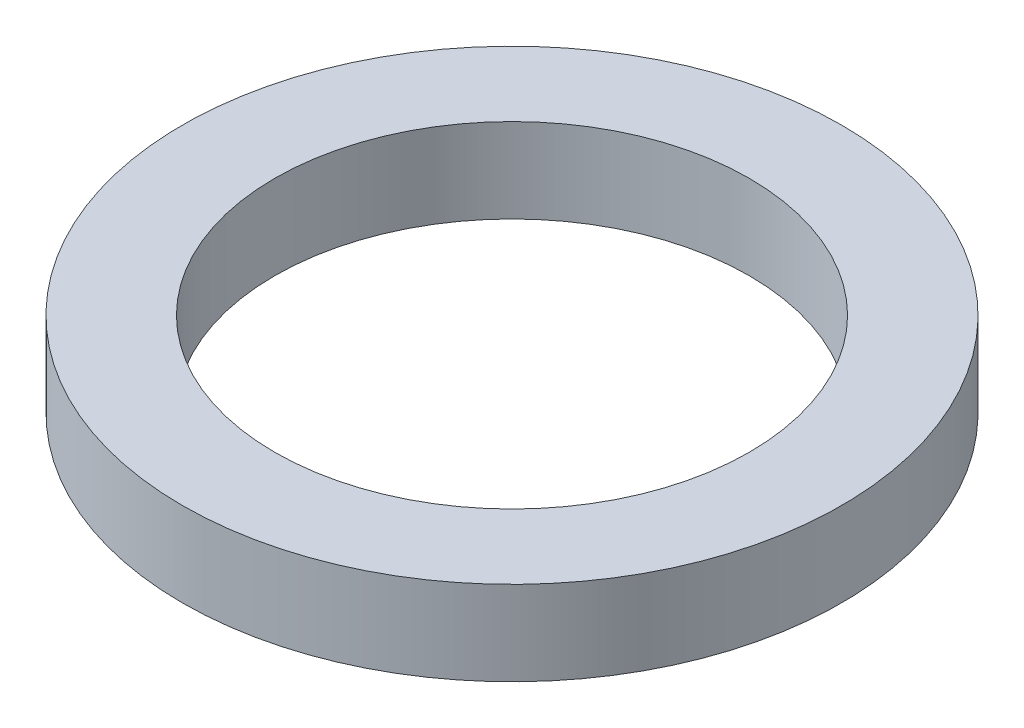
ISO-10303-21;
HEADER;
FILE_DESCRIPTION(('STEP AP214'),'2;1');
FILE_NAME('part.step','',(''),(''),'','','');
FILE_SCHEMA(('AUTOMOTIVE_DESIGN { 1 0 10303 214 1 1 1 1 }'));
ENDSEC;
DATA;
#1=APPLICATION_CONTEXT('core data for automotive mechanical design processes');
#2=APPLICATION_PROTOCOL_DEFINITION('international standard','automotive_design',2000,#1);
#3=PRODUCT_CONTEXT('',#1,'mechanical');
#4=PRODUCT('Part','Part','',(#3));
#5=PRODUCT_RELATED_PRODUCT_CATEGORY('part','',(#4));
#6=PRODUCT_DEFINITION_FORMATION('','',#4);
#7=PRODUCT_DEFINITION_CONTEXT('part definition',#1,'design');
#8=PRODUCT_DEFINITION('design','',#6,#7);
#9=PRODUCT_DEFINITION_SHAPE('','',#8);
#10=(LENGTH_UNIT() NAMED_UNIT(*) SI_UNIT(.MILLI.,.METRE.));
#11=(NAMED_UNIT(*) PLANE_ANGLE_UNIT() SI_UNIT($,.RADIAN.));
#12=(NAMED_UNIT(*) SI_UNIT($,.STERADIAN.) SOLID_ANGLE_UNIT());
#13=UNCERTAINTY_MEASURE_WITH_UNIT(LENGTH_MEASURE(1.E-05),#10,'distance_accuracy_value','');
#14=(GEOMETRIC_REPRESENTATION_CONTEXT(3) GLOBAL_UNCERTAINTY_ASSIGNED_CONTEXT((#13)) GLOBAL_UNIT_ASSIGNED_CONTEXT((#10,
#11,#12)) REPRESENTATION_CONTEXT('',''));
#15=CARTESIAN_POINT('',(0.,0.,0.));
#16=DIRECTION('',(0.,0.,1.));
#17=DIRECTION('',(1.,0.,0.));
#18=AXIS2_PLACEMENT_3D('',#15,#16,#17);
#19=CARTESIAN_POINT('',(0.,16.,0.));
#20=DIRECTION('',(0.,-1.,0.));
#21=DIRECTION('',(0.,0.,-1.));
#22=AXIS2_PLACEMENT_3D('',#19,#20,#21);
#23=CYLINDRICAL_SURFACE('',#22,62.5);
#24=CARTESIAN_POINT('',(0.,16.,0.));
#25=DIRECTION('',(0.,1.,0.));
#26=DIRECTION('',(0.,0.,1.));
#27=AXIS2_PLACEMENT_3D('',#24,#25,#26);
#28=CIRCLE('',#27,62.5);
#29=CARTESIAN_POINT('',(0.,16.,62.5));
#30=VERTEX_POINT('',#29);
#31=EDGE_CURVE('E10',#30,#30,#28,.T.);
#32=ORIENTED_EDGE('',*,*,#31,.F.);
#33=EDGE_LOOP('',(#32));
#34=FACE_BOUND('',#33,.T.);
#35=CARTESIAN_POINT('',(0.,0.,0.));
#36=DIRECTION('',(0.,1.,0.));
#37=DIRECTION('',(0.,0.,1.));
#38=AXIS2_PLACEMENT_3D('',#35,#36,#37);
#39=CIRCLE('',#38,62.5);
#40=CARTESIAN_POINT('',(0.,0.,62.5));
#41=VERTEX_POINT('',#40);
#42=EDGE_CURVE('E37',#41,#41,#39,.T.);
#43=ORIENTED_EDGE('',*,*,#42,.T.);
#44=EDGE_LOOP('',(#43));
#45=FACE_BOUND('',#44,.T.);
#46=ADVANCED_FACE('F40',(#34,#45),#23,.T.);
#47=CARTESIAN_POINT('',(0.,16.,0.));
#48=DIRECTION('',(0.,1.,0.));
#49=DIRECTION('',(0.,0.,1.));
#50=AXIS2_PLACEMENT_3D('',#47,#48,#49);
#51=PLANE('',#50);
#52=CARTESIAN_POINT('',(0.,16.,0.));
#53=DIRECTION('',(0.,1.,0.));
#54=DIRECTION('',(0.,0.,1.));
#55=AXIS2_PLACEMENT_3D('',#52,#53,#54);
#56=CIRCLE('',#55,45.);
#57=CARTESIAN_POINT('',(0.,16.,45.));
#58=VERTEX_POINT('',#57);
#59=EDGE_CURVE('E50',#58,#58,#56,.T.);
#60=ORIENTED_EDGE('',*,*,#59,.F.);
#61=EDGE_LOOP('',(#60));
#62=FACE_BOUND('',#61,.T.);
#63=ORIENTED_EDGE('',*,*,#31,.T.);
#64=EDGE_LOOP('',(#63));
#65=FACE_BOUND('',#64,.T.);
#66=ADVANCED_FACE('F59',(#62,#65),#51,.T.);
#67=CARTESIAN_POINT('',(0.,0.,0.));
#68=DIRECTION('',(0.,1.,0.));
#69=DIRECTION('',(0.,0.,1.));
#70=AXIS2_PLACEMENT_3D('',#67,#68,#69);
#71=PLANE('',#70);
#72=CARTESIAN_POINT('',(0.,0.,0.));
#73=DIRECTION('',(0.,1.,0.));
#74=DIRECTION('',(0.,0.,1.));
#75=AXIS2_PLACEMENT_3D('',#72,#73,#74);
#76=CIRCLE('',#75,45.);
#77=CARTESIAN_POINT('',(0.,0.,45.));
#78=VERTEX_POINT('',#77);
#79=EDGE_CURVE('E47',#78,#78,#76,.T.);
#80=ORIENTED_EDGE('',*,*,#79,.T.);
#81=EDGE_LOOP('',(#80));
#82=FACE_BOUND('',#81,.T.);
#83=ORIENTED_EDGE('',*,*,#42,.F.);
#84=EDGE_LOOP('',(#83));
#85=FACE_BOUND('',#84,.T.);
#86=ADVANCED_FACE('F58',(#82,#85),#71,.F.);
#87=CARTESIAN_POINT('',(0.,16.,0.));
#88=DIRECTION('',(0.,-1.,0.));
#89=DIRECTION('',(0.,0.,-1.));
#90=AXIS2_PLACEMENT_3D('',#87,#88,#89);
#91=CYLINDRICAL_SURFACE('',#90,45.);
#92=ORIENTED_EDGE('',*,*,#59,.T.);
#93=EDGE_LOOP('',(#92));
#94=FACE_BOUND('',#93,.T.);
#95=ORIENTED_EDGE('',*,*,#79,.F.);
#96=EDGE_LOOP('',(#95));
#97=FACE_BOUND('',#96,.T.);
#98=ADVANCED_FACE('F54',(#94,#97),#91,.F.);
#99=CLOSED_SHELL('',(#46,#66,#86,#98));
#100=MANIFOLD_SOLID_BREP('B2',#99);
#101=ADVANCED_BREP_SHAPE_REPRESENTATION('',(#18,#100),#14);
#102=SHAPE_DEFINITION_REPRESENTATION(#9,#101);
ENDSEC;
END-ISO-10303-21;
